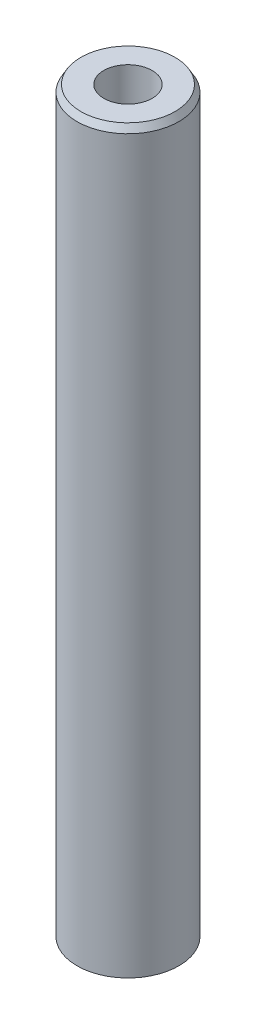
ISO-10303-21;
HEADER;
FILE_DESCRIPTION(('STEP AP214'),'2;1');
FILE_NAME('part.step','',(''),(''),'','','');
FILE_SCHEMA(('AUTOMOTIVE_DESIGN { 1 0 10303 214 1 1 1 1 }'));
ENDSEC;
DATA;
#1=APPLICATION_CONTEXT('core data for automotive mechanical design processes');
#2=APPLICATION_PROTOCOL_DEFINITION('international standard','automotive_design',2000,#1);
#3=PRODUCT_CONTEXT('',#1,'mechanical');
#4=PRODUCT('Part','Part','',(#3));
#5=PRODUCT_RELATED_PRODUCT_CATEGORY('part','',(#4));
#6=PRODUCT_DEFINITION_FORMATION('','',#4);
#7=PRODUCT_DEFINITION_CONTEXT('part definition',#1,'design');
#8=PRODUCT_DEFINITION('design','',#6,#7);
#9=PRODUCT_DEFINITION_SHAPE('','',#8);
#10=(LENGTH_UNIT() NAMED_UNIT(*) SI_UNIT(.MILLI.,.METRE.));
#11=(NAMED_UNIT(*) PLANE_ANGLE_UNIT() SI_UNIT($,.RADIAN.));
#12=(NAMED_UNIT(*) SI_UNIT($,.STERADIAN.) SOLID_ANGLE_UNIT());
#13=UNCERTAINTY_MEASURE_WITH_UNIT(LENGTH_MEASURE(1.E-05),#10,'distance_accuracy_value','');
#14=(GEOMETRIC_REPRESENTATION_CONTEXT(3) GLOBAL_UNCERTAINTY_ASSIGNED_CONTEXT((#13)) GLOBAL_UNIT_ASSIGNED_CONTEXT((#10,
#11,#12)) REPRESENTATION_CONTEXT('',''));
#15=CARTESIAN_POINT('',(0.,0.,0.));
#16=DIRECTION('',(0.,0.,1.));
#17=DIRECTION('',(1.,0.,0.));
#18=AXIS2_PLACEMENT_3D('',#15,#16,#17);
#19=CARTESIAN_POINT('',(0.,291.176222398484,0.));
#20=DIRECTION('',(0.,-1.,0.));
#21=DIRECTION('',(0.,0.,-1.));
#22=AXIS2_PLACEMENT_3D('',#19,#20,#21);
#23=CYLINDRICAL_SURFACE('',#22,20.);
#24=CARTESIAN_POINT('',(0.,288.526759485206,0.));
#25=DIRECTION('',(0.,1.,0.));
#26=DIRECTION('',(0.,0.,1.));
#27=AXIS2_PLACEMENT_3D('',#24,#25,#26);
#28=CIRCLE('',#27,20.);
#29=CARTESIAN_POINT('',(0.,288.526759485206,20.));
#30=VERTEX_POINT('',#29);
#31=EDGE_CURVE('E50',#30,#30,#28,.F.);
#32=ORIENTED_EDGE('',*,*,#31,.T.);
#33=EDGE_LOOP('',(#32));
#34=FACE_BOUND('',#33,.T.);
#35=CARTESIAN_POINT('',(0.,1.52966812618882,0.));
#36=DIRECTION('',(0.,1.,0.));
#37=DIRECTION('',(0.,0.,1.));
#38=AXIS2_PLACEMENT_3D('',#35,#36,#37);
#39=CIRCLE('',#38,20.);
#40=CARTESIAN_POINT('',(0.,1.52966812618882,20.));
#41=VERTEX_POINT('',#40);
#42=EDGE_CURVE('E51',#41,#41,#39,.T.);
#43=ORIENTED_EDGE('',*,*,#42,.T.);
#44=EDGE_LOOP('',(#43));
#45=FACE_BOUND('',#44,.T.);
#46=ADVANCED_FACE('F39',(#34,#45),#23,.T.);
#47=CARTESIAN_POINT('',(0.,291.176222398484,0.));
#48=DIRECTION('',(0.,1.,0.));
#49=DIRECTION('',(0.,0.,1.));
#50=AXIS2_PLACEMENT_3D('',#47,#48,#49);
#51=PLANE('',#50);
#52=CARTESIAN_POINT('',(0.,291.176222398484,0.));
#53=DIRECTION('',(0.,1.,0.));
#54=DIRECTION('',(0.,0.,1.));
#55=AXIS2_PLACEMENT_3D('',#52,#53,#54);
#56=CIRCLE('',#55,18.4703318738111);
#57=CARTESIAN_POINT('',(0.,291.176222398484,18.4703318738111));
#58=VERTEX_POINT('',#57);
#59=EDGE_CURVE('E54',#58,#58,#56,.T.);
#60=ORIENTED_EDGE('',*,*,#59,.T.);
#61=EDGE_LOOP('',(#60));
#62=FACE_BOUND('',#61,.T.);
#63=CARTESIAN_POINT('',(0.,291.176222398484,0.));
#64=DIRECTION('',(0.,1.,0.));
#65=DIRECTION('',(0.,0.,1.));
#66=AXIS2_PLACEMENT_3D('',#63,#64,#65);
#67=CIRCLE('',#66,9.49673136466599);
#68=CARTESIAN_POINT('',(0.,291.176222398484,9.49673136466599));
#69=VERTEX_POINT('',#68);
#70=EDGE_CURVE('E58',#69,#69,#67,.T.);
#71=ORIENTED_EDGE('',*,*,#70,.F.);
#72=EDGE_LOOP('',(#71));
#73=FACE_BOUND('',#72,.T.);
#74=ADVANCED_FACE('F69',(#62,#73),#51,.T.);
#75=CARTESIAN_POINT('',(0.,0.,0.));
#76=DIRECTION('',(0.,1.,0.));
#77=DIRECTION('',(0.,0.,1.));
#78=AXIS2_PLACEMENT_3D('',#75,#76,#77);
#79=PLANE('',#78);
#80=CARTESIAN_POINT('',(0.,0.,0.));
#81=DIRECTION('',(0.,1.,0.));
#82=DIRECTION('',(0.,0.,1.));
#83=AXIS2_PLACEMENT_3D('',#80,#81,#82);
#84=CIRCLE('',#83,17.3505370867223);
#85=CARTESIAN_POINT('',(0.,0.,17.3505370867223));
#86=VERTEX_POINT('',#85);
#87=EDGE_CURVE('E10',#86,#86,#84,.F.);
#88=ORIENTED_EDGE('',*,*,#87,.T.);
#89=EDGE_LOOP('',(#88));
#90=FACE_BOUND('',#89,.T.);
#91=CARTESIAN_POINT('',(0.,0.,0.));
#92=DIRECTION('',(0.,1.,0.));
#93=DIRECTION('',(0.,0.,1.));
#94=AXIS2_PLACEMENT_3D('',#91,#92,#93);
#95=CIRCLE('',#94,9.49673136466599);
#96=CARTESIAN_POINT('',(0.,0.,9.49673136466599));
#97=VERTEX_POINT('',#96);
#98=EDGE_CURVE('E63',#97,#97,#95,.T.);
#99=ORIENTED_EDGE('',*,*,#98,.T.);
#100=EDGE_LOOP('',(#99));
#101=FACE_BOUND('',#100,.T.);
#102=ADVANCED_FACE('F75',(#90,#101),#79,.F.);
#103=CARTESIAN_POINT('',(0.,291.176222398484,0.));
#104=DIRECTION('',(0.,-1.,0.));
#105=DIRECTION('',(0.,0.,-1.));
#106=AXIS2_PLACEMENT_3D('',#103,#104,#105);
#107=CYLINDRICAL_SURFACE('',#106,9.49673136466599);
#108=ORIENTED_EDGE('',*,*,#70,.T.);
#109=EDGE_LOOP('',(#108));
#110=FACE_BOUND('',#109,.T.);
#111=ORIENTED_EDGE('',*,*,#98,.F.);
#112=EDGE_LOOP('',(#111));
#113=FACE_BOUND('',#112,.T.);
#114=ADVANCED_FACE('F70',(#110,#113),#107,.F.);
#115=CARTESIAN_POINT('',(0.,291.176222398484,0.));
#116=DIRECTION('',(0.,-1.,0.));
#117=DIRECTION('',(0.,0.,-1.));
#118=AXIS2_PLACEMENT_3D('',#115,#116,#117);
#119=CONICAL_SURFACE('',#118,18.4703318738111,0.523598775598299);
#120=ORIENTED_EDGE('',*,*,#31,.F.);
#121=EDGE_LOOP('',(#120));
#122=FACE_BOUND('',#121,.T.);
#123=ORIENTED_EDGE('',*,*,#59,.F.);
#124=EDGE_LOOP('',(#123));
#125=FACE_BOUND('',#124,.T.);
#126=ADVANCED_FACE('F81',(#122,#125),#119,.T.);
#127=CARTESIAN_POINT('',(0.,1.52966812618882,0.));
#128=DIRECTION('',(0.,1.,0.));
#129=DIRECTION('',(0.,0.,1.));
#130=AXIS2_PLACEMENT_3D('',#127,#128,#129);
#131=CONICAL_SURFACE('',#130,20.,1.0471975511966);
#132=ORIENTED_EDGE('',*,*,#87,.F.);
#133=EDGE_LOOP('',(#132));
#134=FACE_BOUND('',#133,.T.);
#135=ORIENTED_EDGE('',*,*,#42,.F.);
#136=EDGE_LOOP('',(#135));
#137=FACE_BOUND('',#136,.T.);
#138=ADVANCED_FACE('F45',(#134,#137),#131,.T.);
#139=CLOSED_SHELL('',(#46,#74,#102,#114,#126,#138));
#140=MANIFOLD_SOLID_BREP('B2',#139);
#141=ADVANCED_BREP_SHAPE_REPRESENTATION('',(#18,#140),#14);
#142=SHAPE_DEFINITION_REPRESENTATION(#9,#141);
ENDSEC;
END-ISO-10303-21;
